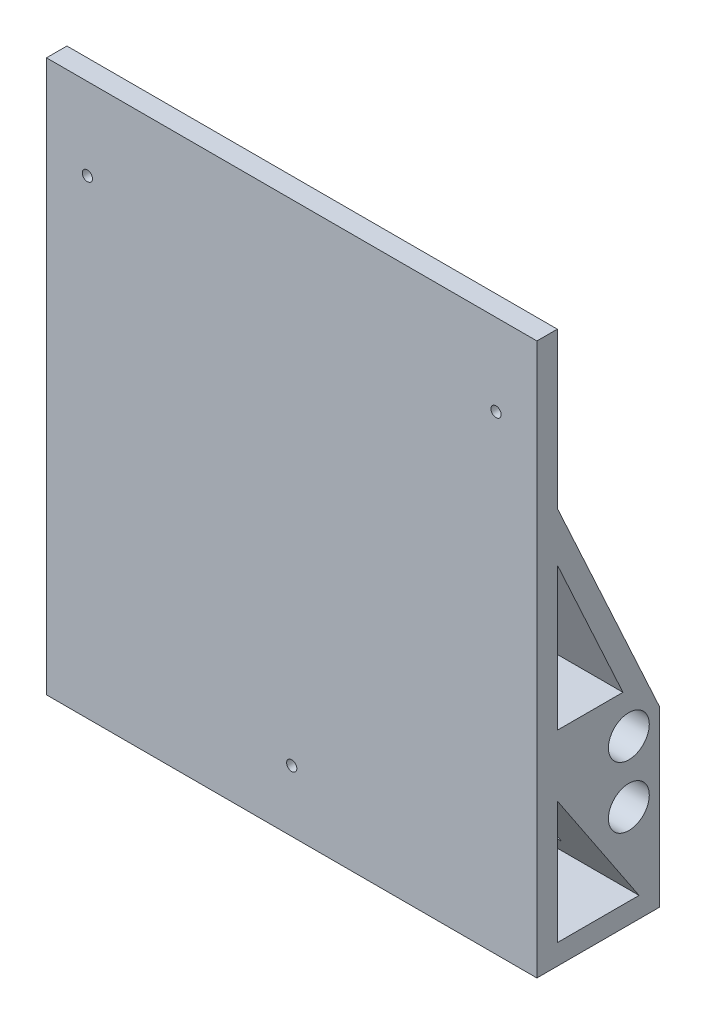
ISO-10303-21;
HEADER;
FILE_DESCRIPTION(('STEP AP214'),'2;1');
FILE_NAME('part.step','',(''),(''),'','','');
FILE_SCHEMA(('AUTOMOTIVE_DESIGN { 1 0 10303 214 1 1 1 1 }'));
ENDSEC;
DATA;
#1=APPLICATION_CONTEXT('core data for automotive mechanical design processes');
#2=APPLICATION_PROTOCOL_DEFINITION('international standard','automotive_design',2000,#1);
#3=PRODUCT_CONTEXT('',#1,'mechanical');
#4=PRODUCT('Part','Part','',(#3));
#5=PRODUCT_RELATED_PRODUCT_CATEGORY('part','',(#4));
#6=PRODUCT_DEFINITION_FORMATION('','',#4);
#7=PRODUCT_DEFINITION_CONTEXT('part definition',#1,'design');
#8=PRODUCT_DEFINITION('design','',#6,#7);
#9=PRODUCT_DEFINITION_SHAPE('','',#8);
#10=(LENGTH_UNIT() NAMED_UNIT(*) SI_UNIT(.MILLI.,.METRE.));
#11=(NAMED_UNIT(*) PLANE_ANGLE_UNIT() SI_UNIT($,.RADIAN.));
#12=(NAMED_UNIT(*) SI_UNIT($,.STERADIAN.) SOLID_ANGLE_UNIT());
#13=UNCERTAINTY_MEASURE_WITH_UNIT(LENGTH_MEASURE(1.E-05),#10,'distance_accuracy_value','');
#14=(GEOMETRIC_REPRESENTATION_CONTEXT(3) GLOBAL_UNCERTAINTY_ASSIGNED_CONTEXT((#13)) GLOBAL_UNIT_ASSIGNED_CONTEXT((#10,
#11,#12)) REPRESENTATION_CONTEXT('',''));
#15=CARTESIAN_POINT('',(0.,0.,0.));
#16=DIRECTION('',(0.,0.,1.));
#17=DIRECTION('',(1.,0.,0.));
#18=AXIS2_PLACEMENT_3D('',#15,#16,#17);
#19=CARTESIAN_POINT('',(-120.,5.,-5.));
#20=DIRECTION('',(0.,0.,1.));
#21=DIRECTION('',(0.,-1.,0.));
#22=AXIS2_PLACEMENT_3D('',#19,#20,#21);
#23=PLANE('',#22);
#24=CARTESIAN_POINT('',(-60.,15.,-5.));
#25=DIRECTION('',(0.,0.,1.));
#26=DIRECTION('',(0.,-1.,0.));
#27=AXIS2_PLACEMENT_3D('',#24,#25,#26);
#28=CIRCLE('',#27,1.25000000000001);
#29=CARTESIAN_POINT('',(-60.,13.75,-5.));
#30=VERTEX_POINT('',#29);
#31=EDGE_CURVE('E275',#30,#30,#28,.T.);
#32=ORIENTED_EDGE('',*,*,#31,.T.);
#33=EDGE_LOOP('',(#32));
#34=FACE_BOUND('',#33,.T.);
#35=DIRECTION('',(0.,1.,0.));
#36=VECTOR('',#35,1.);
#37=CARTESIAN_POINT('',(-105.,33.5,-5.));
#38=LINE('',#37,#36);
#39=CARTESIAN_POINT('',(-105.,33.5,-5.));
#40=VERTEX_POINT('',#39);
#41=CARTESIAN_POINT('',(-105.,35.,-5.));
#42=VERTEX_POINT('',#41);
#43=EDGE_CURVE('E230',#40,#42,#38,.T.);
#44=ORIENTED_EDGE('',*,*,#43,.F.);
#45=DIRECTION('',(-1.,0.,0.));
#46=VECTOR('',#45,1.);
#47=CARTESIAN_POINT('',(-105.,33.5,-5.));
#48=LINE('',#47,#46);
#49=CARTESIAN_POINT('',(-15.,33.5,-5.));
#50=VERTEX_POINT('',#49);
#51=EDGE_CURVE('E227',#50,#40,#48,.T.);
#52=ORIENTED_EDGE('',*,*,#51,.F.);
#53=DIRECTION('',(0.,1.,0.));
#54=VECTOR('',#53,1.);
#55=CARTESIAN_POINT('',(-15.,33.5,-5.));
#56=LINE('',#55,#54);
#57=CARTESIAN_POINT('',(-15.,35.,-5.));
#58=VERTEX_POINT('',#57);
#59=EDGE_CURVE('E233',#50,#58,#56,.T.);
#60=ORIENTED_EDGE('',*,*,#59,.T.);
#61=DIRECTION('',(1.,0.,0.));
#62=VECTOR('',#61,1.);
#63=CARTESIAN_POINT('',(-120.,35.,-5.));
#64=LINE('',#63,#62);
#65=CARTESIAN_POINT('',(0.,35.,-5.));
#66=VERTEX_POINT('',#65);
#67=EDGE_CURVE('E336',#58,#66,#64,.T.);
#68=ORIENTED_EDGE('',*,*,#67,.T.);
#69=DIRECTION('',(0.,-1.,0.));
#70=VECTOR('',#69,1.);
#71=CARTESIAN_POINT('',(0.,5.,-5.));
#72=LINE('',#71,#70);
#73=CARTESIAN_POINT('',(0.,5.,-5.));
#74=VERTEX_POINT('',#73);
#75=EDGE_CURVE('E304',#66,#74,#72,.T.);
#76=ORIENTED_EDGE('',*,*,#75,.T.);
#77=DIRECTION('',(1.,0.,0.));
#78=VECTOR('',#77,1.);
#79=CARTESIAN_POINT('',(-120.,5.,-5.));
#80=LINE('',#79,#78);
#81=CARTESIAN_POINT('',(-120.,5.,-5.));
#82=VERTEX_POINT('',#81);
#83=EDGE_CURVE('E321',#82,#74,#80,.T.);
#84=ORIENTED_EDGE('',*,*,#83,.F.);
#85=DIRECTION('',(0.,-1.,0.));
#86=VECTOR('',#85,1.);
#87=CARTESIAN_POINT('',(-120.,5.,-5.));
#88=LINE('',#87,#86);
#89=CARTESIAN_POINT('',(-120.,35.,-5.));
#90=VERTEX_POINT('',#89);
#91=EDGE_CURVE('E308',#90,#82,#88,.T.);
#92=ORIENTED_EDGE('',*,*,#91,.F.);
#93=EDGE_CURVE('E331',#90,#42,#64,.T.);
#94=ORIENTED_EDGE('',*,*,#93,.T.);
#95=EDGE_LOOP('',(#44,#52,#60,#68,#76,#84,#92,#94));
#96=FACE_BOUND('',#95,.T.);
#97=ADVANCED_FACE('F38',(#34,#96),#23,.F.);
#98=CARTESIAN_POINT('',(-120.,40.,-22.5));
#99=DIRECTION('',(1.,0.,0.));
#100=DIRECTION('',(0.,0.,-1.));
#101=AXIS2_PLACEMENT_3D('',#98,#99,#100);
#102=CYLINDRICAL_SURFACE('',#101,5.);
#103=CARTESIAN_POINT('',(0.,40.,-22.5));
#104=DIRECTION('',(1.,0.,0.));
#105=DIRECTION('',(0.,0.,-1.));
#106=AXIS2_PLACEMENT_3D('',#103,#104,#105);
#107=CIRCLE('',#106,5.);
#108=CARTESIAN_POINT('',(0.,40.,-27.5));
#109=VERTEX_POINT('',#108);
#110=EDGE_CURVE('E288',#109,#109,#107,.T.);
#111=ORIENTED_EDGE('',*,*,#110,.T.);
#112=EDGE_LOOP('',(#111));
#113=FACE_BOUND('',#112,.T.);
#114=CARTESIAN_POINT('',(-9.99999999999999,40.,-22.5));
#115=DIRECTION('',(-1.,0.,0.));
#116=DIRECTION('',(0.,-1.,0.));
#117=AXIS2_PLACEMENT_3D('',#114,#115,#116);
#118=CIRCLE('',#117,5.);
#119=CARTESIAN_POINT('',(-9.99999999999999,35.,-22.5));
#120=VERTEX_POINT('',#119);
#121=EDGE_CURVE('E11',#120,#120,#118,.F.);
#122=ORIENTED_EDGE('',*,*,#121,.F.);
#123=EDGE_LOOP('',(#122));
#124=FACE_BOUND('',#123,.T.);
#125=ADVANCED_FACE('F507',(#113,#124),#102,.F.);
#126=CARTESIAN_POINT('',(-120.,25.,-22.5));
#127=DIRECTION('',(1.,0.,0.));
#128=DIRECTION('',(0.,0.,-1.));
#129=AXIS2_PLACEMENT_3D('',#126,#127,#128);
#130=CYLINDRICAL_SURFACE('',#129,5.);
#131=CARTESIAN_POINT('',(-120.,25.,-22.5));
#132=DIRECTION('',(1.,0.,0.));
#133=DIRECTION('',(0.,0.,-1.));
#134=AXIS2_PLACEMENT_3D('',#131,#132,#133);
#135=CIRCLE('',#134,5.);
#136=CARTESIAN_POINT('',(-120.,25.,-27.5));
#137=VERTEX_POINT('',#136);
#138=EDGE_CURVE('E300',#137,#137,#135,.T.);
#139=ORIENTED_EDGE('',*,*,#138,.F.);
#140=EDGE_LOOP('',(#139));
#141=FACE_BOUND('',#140,.T.);
#142=CARTESIAN_POINT('',(-110.,25.,-22.5));
#143=DIRECTION('',(1.,0.,0.));
#144=DIRECTION('',(0.,0.,-1.));
#145=AXIS2_PLACEMENT_3D('',#142,#143,#144);
#146=CIRCLE('',#145,5.);
#147=CARTESIAN_POINT('',(-110.,25.,-27.5));
#148=VERTEX_POINT('',#147);
#149=EDGE_CURVE('E48',#148,#148,#146,.F.);
#150=ORIENTED_EDGE('',*,*,#149,.F.);
#151=EDGE_LOOP('',(#150));
#152=FACE_BOUND('',#151,.T.);
#153=ADVANCED_FACE('F515',(#141,#152),#130,.F.);
#154=CARTESIAN_POINT('',(0.,25.,-22.5));
#155=DIRECTION('',(1.,0.,0.));
#156=DIRECTION('',(0.,0.,-1.));
#157=AXIS2_PLACEMENT_3D('',#154,#155,#156);
#158=CIRCLE('',#157,5.);
#159=CARTESIAN_POINT('',(0.,25.,-27.5));
#160=VERTEX_POINT('',#159);
#161=EDGE_CURVE('E296',#160,#160,#158,.T.);
#162=ORIENTED_EDGE('',*,*,#161,.T.);
#163=EDGE_LOOP('',(#162));
#164=FACE_BOUND('',#163,.T.);
#165=CARTESIAN_POINT('',(-9.99999999999999,25.,-22.5));
#166=DIRECTION('',(-1.,0.,0.));
#167=DIRECTION('',(0.,-1.,0.));
#168=AXIS2_PLACEMENT_3D('',#165,#166,#167);
#169=CIRCLE('',#168,5.);
#170=CARTESIAN_POINT('',(-9.99999999999999,20.,-22.5));
#171=VERTEX_POINT('',#170);
#172=EDGE_CURVE('E417',#171,#171,#169,.F.);
#173=ORIENTED_EDGE('',*,*,#172,.F.);
#174=EDGE_LOOP('',(#173));
#175=FACE_BOUND('',#174,.T.);
#176=ADVANCED_FACE('F751',(#164,#175),#130,.F.);
#177=CARTESIAN_POINT('',(-120.,0.,0.));
#178=DIRECTION('',(0.,-1.,0.));
#179=DIRECTION('',(0.,0.,-1.));
#180=AXIS2_PLACEMENT_3D('',#177,#178,#179);
#181=PLANE('',#180);
#182=DIRECTION('',(0.,0.,-1.));
#183=VECTOR('',#182,1.);
#184=CARTESIAN_POINT('',(0.,0.,0.));
#185=LINE('',#184,#183);
#186=CARTESIAN_POINT('',(0.,0.,0.));
#187=VERTEX_POINT('',#186);
#188=CARTESIAN_POINT('',(0.,0.,-30.));
#189=VERTEX_POINT('',#188);
#190=EDGE_CURVE('E335',#187,#189,#185,.T.);
#191=ORIENTED_EDGE('',*,*,#190,.F.);
#192=DIRECTION('',(1.,0.,0.));
#193=VECTOR('',#192,1.);
#194=CARTESIAN_POINT('',(-120.,0.,0.));
#195=LINE('',#194,#193);
#196=CARTESIAN_POINT('',(-120.,0.,0.));
#197=VERTEX_POINT('',#196);
#198=EDGE_CURVE('E391',#197,#187,#195,.T.);
#199=ORIENTED_EDGE('',*,*,#198,.F.);
#200=DIRECTION('',(0.,0.,-1.));
#201=VECTOR('',#200,1.);
#202=CARTESIAN_POINT('',(-120.,0.,0.));
#203=LINE('',#202,#201);
#204=CARTESIAN_POINT('',(-120.,0.,-30.));
#205=VERTEX_POINT('',#204);
#206=EDGE_CURVE('E343',#197,#205,#203,.T.);
#207=ORIENTED_EDGE('',*,*,#206,.T.);
#208=DIRECTION('',(1.,0.,0.));
#209=VECTOR('',#208,1.);
#210=CARTESIAN_POINT('',(-120.,0.,-30.));
#211=LINE('',#210,#209);
#212=CARTESIAN_POINT('',(-60.,0.,-30.));
#213=VERTEX_POINT('',#212);
#214=EDGE_CURVE('E407',#205,#213,#211,.T.);
#215=ORIENTED_EDGE('',*,*,#214,.T.);
#216=EDGE_CURVE('E368',#213,#189,#211,.T.);
#217=ORIENTED_EDGE('',*,*,#216,.T.);
#218=EDGE_LOOP('',(#191,#199,#207,#215,#217));
#219=FACE_BOUND('',#218,.T.);
#220=ADVANCED_FACE('F40',(#219),#181,.T.);
#221=CARTESIAN_POINT('',(-120.,0.,0.));
#222=DIRECTION('',(0.,0.,1.));
#223=DIRECTION('',(1.,0.,0.));
#224=AXIS2_PLACEMENT_3D('',#221,#222,#223);
#225=PLANE('',#224);
#226=CARTESIAN_POINT('',(-110.,115.,0.));
#227=DIRECTION('',(0.,0.,1.));
#228=DIRECTION('',(1.,0.,0.));
#229=AXIS2_PLACEMENT_3D('',#226,#227,#228);
#230=CIRCLE('',#229,1.25);
#231=CARTESIAN_POINT('',(-108.75,115.,0.));
#232=VERTEX_POINT('',#231);
#233=EDGE_CURVE('E206',#232,#232,#230,.T.);
#234=ORIENTED_EDGE('',*,*,#233,.F.);
#235=EDGE_LOOP('',(#234));
#236=FACE_BOUND('',#235,.T.);
#237=CARTESIAN_POINT('',(-9.99999999999999,115.,0.));
#238=DIRECTION('',(0.,0.,1.));
#239=DIRECTION('',(-1.,0.,0.));
#240=AXIS2_PLACEMENT_3D('',#237,#238,#239);
#241=CIRCLE('',#240,1.25);
#242=CARTESIAN_POINT('',(-11.25,115.,0.));
#243=VERTEX_POINT('',#242);
#244=EDGE_CURVE('E203',#243,#243,#241,.T.);
#245=ORIENTED_EDGE('',*,*,#244,.F.);
#246=EDGE_LOOP('',(#245));
#247=FACE_BOUND('',#246,.T.);
#248=CARTESIAN_POINT('',(-60.,15.,0.));
#249=DIRECTION('',(0.,0.,1.));
#250=DIRECTION('',(1.,0.,0.));
#251=AXIS2_PLACEMENT_3D('',#248,#249,#250);
#252=CIRCLE('',#251,1.25000000000001);
#253=CARTESIAN_POINT('',(-58.75,15.,0.));
#254=VERTEX_POINT('',#253);
#255=EDGE_CURVE('E271',#254,#254,#252,.T.);
#256=ORIENTED_EDGE('',*,*,#255,.F.);
#257=EDGE_LOOP('',(#256));
#258=FACE_BOUND('',#257,.T.);
#259=DIRECTION('',(0.,-1.,0.));
#260=VECTOR('',#259,1.);
#261=CARTESIAN_POINT('',(0.,0.,0.));
#262=LINE('',#261,#260);
#263=CARTESIAN_POINT('',(0.,135.,0.));
#264=VERTEX_POINT('',#263);
#265=EDGE_CURVE('E348',#264,#187,#262,.T.);
#266=ORIENTED_EDGE('',*,*,#265,.F.);
#267=DIRECTION('',(1.,0.,0.));
#268=VECTOR('',#267,1.);
#269=CARTESIAN_POINT('',(-120.,135.,0.));
#270=LINE('',#269,#268);
#271=CARTESIAN_POINT('',(-120.,135.,0.));
#272=VERTEX_POINT('',#271);
#273=EDGE_CURVE('E395',#272,#264,#270,.T.);
#274=ORIENTED_EDGE('',*,*,#273,.F.);
#275=DIRECTION('',(0.,-1.,0.));
#276=VECTOR('',#275,1.);
#277=CARTESIAN_POINT('',(-120.,0.,0.));
#278=LINE('',#277,#276);
#279=EDGE_CURVE('E364',#272,#197,#278,.T.);
#280=ORIENTED_EDGE('',*,*,#279,.T.);
#281=ORIENTED_EDGE('',*,*,#198,.T.);
#282=EDGE_LOOP('',(#266,#274,#280,#281));
#283=FACE_BOUND('',#282,.T.);
#284=ADVANCED_FACE('F482',(#236,#247,#258,#283),#225,.T.);
#285=CARTESIAN_POINT('',(-120.,135.,0.));
#286=DIRECTION('',(0.,1.,0.));
#287=DIRECTION('',(0.,0.,1.));
#288=AXIS2_PLACEMENT_3D('',#285,#286,#287);
#289=PLANE('',#288);
#290=DIRECTION('',(0.,0.,1.));
#291=VECTOR('',#290,1.);
#292=CARTESIAN_POINT('',(0.,135.,0.));
#293=LINE('',#292,#291);
#294=CARTESIAN_POINT('',(0.,135.,-5.));
#295=VERTEX_POINT('',#294);
#296=EDGE_CURVE('E384',#295,#264,#293,.T.);
#297=ORIENTED_EDGE('',*,*,#296,.F.);
#298=DIRECTION('',(1.,0.,0.));
#299=VECTOR('',#298,1.);
#300=CARTESIAN_POINT('',(-120.,135.,-5.));
#301=LINE('',#300,#299);
#302=CARTESIAN_POINT('',(-120.,135.,-5.));
#303=VERTEX_POINT('',#302);
#304=EDGE_CURVE('E398',#303,#295,#301,.T.);
#305=ORIENTED_EDGE('',*,*,#304,.F.);
#306=DIRECTION('',(0.,0.,1.));
#307=VECTOR('',#306,1.);
#308=CARTESIAN_POINT('',(-120.,135.,0.));
#309=LINE('',#308,#307);
#310=EDGE_CURVE('E360',#303,#272,#309,.T.);
#311=ORIENTED_EDGE('',*,*,#310,.T.);
#312=ORIENTED_EDGE('',*,*,#273,.T.);
#313=EDGE_LOOP('',(#297,#305,#311,#312));
#314=FACE_BOUND('',#313,.T.);
#315=ADVANCED_FACE('F527',(#314),#289,.T.);
#316=CARTESIAN_POINT('',(-120.,97.,-5.));
#317=DIRECTION('',(0.,0.,-1.));
#318=DIRECTION('',(0.,1.,0.));
#319=AXIS2_PLACEMENT_3D('',#316,#317,#318);
#320=PLANE('',#319);
#321=CARTESIAN_POINT('',(-110.,115.,-5.));
#322=DIRECTION('',(0.,0.,-1.));
#323=DIRECTION('',(0.,1.,0.));
#324=AXIS2_PLACEMENT_3D('',#321,#322,#323);
#325=CIRCLE('',#324,1.25);
#326=CARTESIAN_POINT('',(-110.,116.25,-5.));
#327=VERTEX_POINT('',#326);
#328=EDGE_CURVE('E42',#327,#327,#325,.T.);
#329=ORIENTED_EDGE('',*,*,#328,.F.);
#330=EDGE_LOOP('',(#329));
#331=FACE_BOUND('',#330,.T.);
#332=CARTESIAN_POINT('',(-9.99999999999999,115.,-5.));
#333=DIRECTION('',(0.,0.,-1.));
#334=DIRECTION('',(0.,1.,0.));
#335=AXIS2_PLACEMENT_3D('',#332,#333,#334);
#336=CIRCLE('',#335,1.25);
#337=CARTESIAN_POINT('',(-9.99999999999999,116.25,-5.));
#338=VERTEX_POINT('',#337);
#339=EDGE_CURVE('E210',#338,#338,#336,.T.);
#340=ORIENTED_EDGE('',*,*,#339,.F.);
#341=EDGE_LOOP('',(#340));
#342=FACE_BOUND('',#341,.T.);
#343=DIRECTION('',(0.,1.,0.));
#344=VECTOR('',#343,1.);
#345=CARTESIAN_POINT('',(0.,97.,-5.));
#346=LINE('',#345,#344);
#347=CARTESIAN_POINT('',(0.,97.,-5.));
#348=VERTEX_POINT('',#347);
#349=EDGE_CURVE('E380',#348,#295,#346,.T.);
#350=ORIENTED_EDGE('',*,*,#349,.F.);
#351=DIRECTION('',(1.,0.,0.));
#352=VECTOR('',#351,1.);
#353=CARTESIAN_POINT('',(-120.,97.,-5.));
#354=LINE('',#353,#352);
#355=CARTESIAN_POINT('',(-120.,97.,-5.));
#356=VERTEX_POINT('',#355);
#357=EDGE_CURVE('E401',#356,#348,#354,.T.);
#358=ORIENTED_EDGE('',*,*,#357,.F.);
#359=DIRECTION('',(0.,1.,0.));
#360=VECTOR('',#359,1.);
#361=CARTESIAN_POINT('',(-120.,97.,-5.));
#362=LINE('',#361,#360);
#363=EDGE_CURVE('E356',#356,#303,#362,.T.);
#364=ORIENTED_EDGE('',*,*,#363,.T.);
#365=ORIENTED_EDGE('',*,*,#304,.T.);
#366=EDGE_LOOP('',(#350,#358,#364,#365));
#367=FACE_BOUND('',#366,.T.);
#368=ADVANCED_FACE('F531',(#331,#342,#367),#320,.T.);
#369=CARTESIAN_POINT('',(-120.,42.5,-30.));
#370=DIRECTION('',(0.,0.41694182324625,-0.908933174676826));
#371=DIRECTION('',(0.,0.908933174676826,0.41694182324625));
#372=AXIS2_PLACEMENT_3D('',#369,#370,#371);
#373=PLANE('',#372);
#374=CARTESIAN_POINT('',(-60.,52.25,-25.5275229357798));
#375=DIRECTION('',(0.,0.41694182324625,-0.908933174676826));
#376=DIRECTION('',(0.,-0.908933174676826,-0.41694182324625));
#377=AXIS2_PLACEMENT_3D('',#374,#375,#376);
#378=ELLIPSE('',#377,4.12571584410848,3.75);
#379=CARTESIAN_POINT('',(-60.,48.5,-27.2477064220184));
#380=VERTEX_POINT('',#379);
#381=EDGE_CURVE('E394',#380,#380,#378,.T.);
#382=ORIENTED_EDGE('',*,*,#381,.F.);
#383=EDGE_LOOP('',(#382));
#384=FACE_BOUND('',#383,.T.);
#385=DIRECTION('',(0.,0.908933174676826,0.41694182324625));
#386=VECTOR('',#385,1.);
#387=CARTESIAN_POINT('',(0.,42.5,-30.));
#388=LINE('',#387,#386);
#389=CARTESIAN_POINT('',(0.,42.5,-30.));
#390=VERTEX_POINT('',#389);
#391=EDGE_CURVE('E376',#390,#348,#388,.T.);
#392=ORIENTED_EDGE('',*,*,#391,.F.);
#393=DIRECTION('',(1.,0.,0.));
#394=VECTOR('',#393,1.);
#395=CARTESIAN_POINT('',(-120.,42.5,-30.));
#396=LINE('',#395,#394);
#397=CARTESIAN_POINT('',(-120.,42.5,-30.));
#398=VERTEX_POINT('',#397);
#399=EDGE_CURVE('E404',#398,#390,#396,.T.);
#400=ORIENTED_EDGE('',*,*,#399,.F.);
#401=DIRECTION('',(0.,0.908933174676826,0.41694182324625));
#402=VECTOR('',#401,1.);
#403=CARTESIAN_POINT('',(-120.,42.5,-30.));
#404=LINE('',#403,#402);
#405=EDGE_CURVE('E352',#398,#356,#404,.T.);
#406=ORIENTED_EDGE('',*,*,#405,.T.);
#407=ORIENTED_EDGE('',*,*,#357,.T.);
#408=EDGE_LOOP('',(#392,#400,#406,#407));
#409=FACE_BOUND('',#408,.T.);
#410=ADVANCED_FACE('F535',(#384,#409),#373,.T.);
#411=CARTESIAN_POINT('',(-120.,0.,-30.));
#412=DIRECTION('',(0.,0.,-1.));
#413=DIRECTION('',(-1.,0.,0.));
#414=AXIS2_PLACEMENT_3D('',#411,#412,#413);
#415=PLANE('',#414);
#416=DIRECTION('',(1.,0.,0.));
#417=VECTOR('',#416,1.);
#418=CARTESIAN_POINT('',(-105.,33.5,-30.));
#419=LINE('',#418,#417);
#420=CARTESIAN_POINT('',(-105.,33.5,-30.));
#421=VERTEX_POINT('',#420);
#422=CARTESIAN_POINT('',(-15.,33.5,-30.));
#423=VERTEX_POINT('',#422);
#424=EDGE_CURVE('E218',#421,#423,#419,.T.);
#425=ORIENTED_EDGE('',*,*,#424,.F.);
#426=DIRECTION('',(0.,1.,0.));
#427=VECTOR('',#426,1.);
#428=CARTESIAN_POINT('',(-105.,11.,-30.));
#429=LINE('',#428,#427);
#430=CARTESIAN_POINT('',(-105.,11.,-30.));
#431=VERTEX_POINT('',#430);
#432=EDGE_CURVE('E251',#431,#421,#429,.T.);
#433=ORIENTED_EDGE('',*,*,#432,.F.);
#434=DIRECTION('',(-1.,0.,0.));
#435=VECTOR('',#434,1.);
#436=CARTESIAN_POINT('',(-15.,11.,-30.));
#437=LINE('',#436,#435);
#438=CARTESIAN_POINT('',(-15.,11.,-30.));
#439=VERTEX_POINT('',#438);
#440=EDGE_CURVE('E247',#439,#431,#437,.T.);
#441=ORIENTED_EDGE('',*,*,#440,.F.);
#442=DIRECTION('',(0.,-1.,0.));
#443=VECTOR('',#442,1.);
#444=CARTESIAN_POINT('',(-15.,36.,-30.));
#445=LINE('',#444,#443);
#446=EDGE_CURVE('E244',#423,#439,#445,.T.);
#447=ORIENTED_EDGE('',*,*,#446,.F.);
#448=EDGE_LOOP('',(#425,#433,#441,#447));
#449=FACE_BOUND('',#448,.T.);
#450=ORIENTED_EDGE('',*,*,#216,.F.);
#451=CARTESIAN_POINT('',(-60.,3.75,-30.));
#452=DIRECTION('',(0.,0.,-1.));
#453=DIRECTION('',(-1.,0.,0.));
#454=AXIS2_PLACEMENT_3D('',#451,#452,#453);
#455=CIRCLE('',#454,3.75000000000001);
#456=EDGE_CURVE('E283',#213,#213,#455,.T.);
#457=ORIENTED_EDGE('',*,*,#456,.F.);
#458=ORIENTED_EDGE('',*,*,#214,.F.);
#459=DIRECTION('',(0.,1.,0.));
#460=VECTOR('',#459,1.);
#461=CARTESIAN_POINT('',(-120.,0.,-30.));
#462=LINE('',#461,#460);
#463=EDGE_CURVE('E347',#205,#398,#462,.T.);
#464=ORIENTED_EDGE('',*,*,#463,.T.);
#465=ORIENTED_EDGE('',*,*,#399,.T.);
#466=DIRECTION('',(0.,1.,0.));
#467=VECTOR('',#466,1.);
#468=CARTESIAN_POINT('',(0.,0.,-30.));
#469=LINE('',#468,#467);
#470=EDGE_CURVE('E372',#189,#390,#469,.T.);
#471=ORIENTED_EDGE('',*,*,#470,.F.);
#472=EDGE_LOOP('',(#450,#457,#458,#464,#465,#471));
#473=FACE_BOUND('',#472,.T.);
#474=ADVANCED_FACE('F442',(#449,#473),#415,.T.);
#475=CARTESIAN_POINT('',(-120.,0.,0.));
#476=DIRECTION('',(1.,0.,0.));
#477=DIRECTION('',(0.,0.,-1.));
#478=AXIS2_PLACEMENT_3D('',#475,#476,#477);
#479=PLANE('',#478);
#480=DIRECTION('',(0.,0.,-1.));
#481=VECTOR('',#480,1.);
#482=CARTESIAN_POINT('',(-120.,50.0079192797913,-5.00000000000001));
#483=LINE('',#482,#481);
#484=CARTESIAN_POINT('',(-120.,50.0079192797913,-5.00000000000001));
#485=VERTEX_POINT('',#484);
#486=CARTESIAN_POINT('',(-120.,50.0079192797913,-21.0550458715596));
#487=VERTEX_POINT('',#486);
#488=EDGE_CURVE('E56',#485,#487,#483,.T.);
#489=ORIENTED_EDGE('',*,*,#488,.T.);
#490=DIRECTION('',(0.,0.908933174676826,0.41694182324625));
#491=VECTOR('',#490,1.);
#492=CARTESIAN_POINT('',(-120.,50.0079192797913,-21.0550458715596));
#493=LINE('',#492,#491);
#494=CARTESIAN_POINT('',(-120.,85.0079192797914,-5.));
#495=VERTEX_POINT('',#494);
#496=EDGE_CURVE('E171',#487,#495,#493,.T.);
#497=ORIENTED_EDGE('',*,*,#496,.T.);
#498=DIRECTION('',(0.,-1.,0.));
#499=VECTOR('',#498,1.);
#500=CARTESIAN_POINT('',(-120.,85.0079192797914,-5.));
#501=LINE('',#500,#499);
#502=EDGE_CURVE('E179',#495,#485,#501,.T.);
#503=ORIENTED_EDGE('',*,*,#502,.T.);
#504=EDGE_LOOP('',(#489,#497,#503));
#505=FACE_BOUND('',#504,.T.);
#506=CARTESIAN_POINT('',(-120.,40.,-22.5));
#507=DIRECTION('',(1.,0.,0.));
#508=DIRECTION('',(0.,0.,-1.));
#509=AXIS2_PLACEMENT_3D('',#506,#507,#508);
#510=CIRCLE('',#509,5.);
#511=CARTESIAN_POINT('',(-120.,40.,-27.5));
#512=VERTEX_POINT('',#511);
#513=EDGE_CURVE('E292',#512,#512,#510,.T.);
#514=ORIENTED_EDGE('',*,*,#513,.T.);
#515=EDGE_LOOP('',(#514));
#516=FACE_BOUND('',#515,.T.);
#517=ORIENTED_EDGE('',*,*,#138,.T.);
#518=EDGE_LOOP('',(#517));
#519=FACE_BOUND('',#518,.T.);
#520=DIRECTION('',(0.,0.832050294337844,0.554700196225229));
#521=VECTOR('',#520,1.);
#522=CARTESIAN_POINT('',(-120.,5.,-25.));
#523=LINE('',#522,#521);
#524=CARTESIAN_POINT('',(-120.,5.,-25.));
#525=VERTEX_POINT('',#524);
#526=EDGE_CURVE('E317',#525,#90,#523,.T.);
#527=ORIENTED_EDGE('',*,*,#526,.T.);
#528=ORIENTED_EDGE('',*,*,#91,.T.);
#529=DIRECTION('',(0.,0.,-1.));
#530=VECTOR('',#529,1.);
#531=CARTESIAN_POINT('',(-120.,5.,-5.));
#532=LINE('',#531,#530);
#533=EDGE_CURVE('E312',#82,#525,#532,.T.);
#534=ORIENTED_EDGE('',*,*,#533,.T.);
#535=EDGE_LOOP('',(#527,#528,#534));
#536=FACE_BOUND('',#535,.T.);
#537=ORIENTED_EDGE('',*,*,#206,.F.);
#538=ORIENTED_EDGE('',*,*,#279,.F.);
#539=ORIENTED_EDGE('',*,*,#310,.F.);
#540=ORIENTED_EDGE('',*,*,#363,.F.);
#541=ORIENTED_EDGE('',*,*,#405,.F.);
#542=ORIENTED_EDGE('',*,*,#463,.F.);
#543=EDGE_LOOP('',(#537,#538,#539,#540,#541,#542));
#544=FACE_BOUND('',#543,.T.);
#545=ADVANCED_FACE('F184',(#505,#516,#519,#536,#544),#479,.F.);
#546=CARTESIAN_POINT('',(0.,0.,0.));
#547=DIRECTION('',(1.,0.,0.));
#548=DIRECTION('',(0.,0.,-1.));
#549=AXIS2_PLACEMENT_3D('',#546,#547,#548);
#550=PLANE('',#549);
#551=DIRECTION('',(0.,0.908933174676826,0.41694182324625));
#552=VECTOR('',#551,1.);
#553=CARTESIAN_POINT('',(0.,50.0079192797913,-21.0550458715596));
#554=LINE('',#553,#552);
#555=CARTESIAN_POINT('',(0.,50.0079192797913,-21.0550458715596));
#556=VERTEX_POINT('',#555);
#557=CARTESIAN_POINT('',(0.,85.0079192797914,-5.));
#558=VERTEX_POINT('',#557);
#559=EDGE_CURVE('E64',#556,#558,#554,.T.);
#560=ORIENTED_EDGE('',*,*,#559,.F.);
#561=DIRECTION('',(0.,0.,-1.));
#562=VECTOR('',#561,1.);
#563=CARTESIAN_POINT('',(0.,50.0079192797913,-5.00000000000001));
#564=LINE('',#563,#562);
#565=CARTESIAN_POINT('',(0.,50.0079192797913,-5.00000000000001));
#566=VERTEX_POINT('',#565);
#567=EDGE_CURVE('E187',#566,#556,#564,.T.);
#568=ORIENTED_EDGE('',*,*,#567,.F.);
#569=DIRECTION('',(0.,-1.,0.));
#570=VECTOR('',#569,1.);
#571=CARTESIAN_POINT('',(0.,85.0079192797914,-5.));
#572=LINE('',#571,#570);
#573=EDGE_CURVE('E191',#558,#566,#572,.T.);
#574=ORIENTED_EDGE('',*,*,#573,.F.);
#575=EDGE_LOOP('',(#560,#568,#574));
#576=FACE_BOUND('',#575,.T.);
#577=ORIENTED_EDGE('',*,*,#110,.F.);
#578=EDGE_LOOP('',(#577));
#579=FACE_BOUND('',#578,.T.);
#580=ORIENTED_EDGE('',*,*,#161,.F.);
#581=EDGE_LOOP('',(#580));
#582=FACE_BOUND('',#581,.T.);
#583=ORIENTED_EDGE('',*,*,#75,.F.);
#584=DIRECTION('',(0.,0.832050294337844,0.554700196225229));
#585=VECTOR('',#584,1.);
#586=CARTESIAN_POINT('',(0.,5.,-25.));
#587=LINE('',#586,#585);
#588=CARTESIAN_POINT('',(0.,5.,-25.));
#589=VERTEX_POINT('',#588);
#590=EDGE_CURVE('E313',#589,#66,#587,.T.);
#591=ORIENTED_EDGE('',*,*,#590,.F.);
#592=DIRECTION('',(0.,0.,-1.));
#593=VECTOR('',#592,1.);
#594=CARTESIAN_POINT('',(0.,5.,-5.));
#595=LINE('',#594,#593);
#596=EDGE_CURVE('E324',#74,#589,#595,.T.);
#597=ORIENTED_EDGE('',*,*,#596,.F.);
#598=EDGE_LOOP('',(#583,#591,#597));
#599=FACE_BOUND('',#598,.T.);
#600=ORIENTED_EDGE('',*,*,#190,.T.);
#601=ORIENTED_EDGE('',*,*,#470,.T.);
#602=ORIENTED_EDGE('',*,*,#391,.T.);
#603=ORIENTED_EDGE('',*,*,#349,.T.);
#604=ORIENTED_EDGE('',*,*,#296,.T.);
#605=ORIENTED_EDGE('',*,*,#265,.T.);
#606=EDGE_LOOP('',(#600,#601,#602,#603,#604,#605));
#607=FACE_BOUND('',#606,.T.);
#608=ADVANCED_FACE('F478',(#576,#579,#582,#599,#607),#550,.T.);
#609=CARTESIAN_POINT('',(-120.,5.,-25.));
#610=DIRECTION('',(0.,0.554700196225229,-0.832050294337844));
#611=DIRECTION('',(0.,0.832050294337844,0.554700196225229));
#612=AXIS2_PLACEMENT_3D('',#609,#610,#611);
#613=PLANE('',#612);
#614=DIRECTION('',(-1.,0.,0.));
#615=VECTOR('',#614,1.);
#616=CARTESIAN_POINT('',(-120.,11.,-21.));
#617=LINE('',#616,#615);
#618=CARTESIAN_POINT('',(-15.,11.,-21.));
#619=VERTEX_POINT('',#618);
#620=CARTESIAN_POINT('',(-105.,11.,-21.));
#621=VERTEX_POINT('',#620);
#622=EDGE_CURVE('E413',#619,#621,#617,.T.);
#623=ORIENTED_EDGE('',*,*,#622,.T.);
#624=DIRECTION('',(0.,0.832050294337844,0.554700196225229));
#625=VECTOR('',#624,1.);
#626=CARTESIAN_POINT('',(-105.,5.,-25.));
#627=LINE('',#626,#625);
#628=CARTESIAN_POINT('',(-105.,33.5,-5.99999999999999));
#629=VERTEX_POINT('',#628);
#630=EDGE_CURVE('E267',#621,#629,#627,.T.);
#631=ORIENTED_EDGE('',*,*,#630,.T.);
#632=DIRECTION('',(0.,-0.832050294337844,-0.554700196225229));
#633=VECTOR('',#632,1.);
#634=CARTESIAN_POINT('',(-105.,5.,-25.));
#635=LINE('',#634,#633);
#636=EDGE_CURVE('E237',#42,#629,#635,.T.);
#637=ORIENTED_EDGE('',*,*,#636,.F.);
#638=ORIENTED_EDGE('',*,*,#93,.F.);
#639=ORIENTED_EDGE('',*,*,#526,.F.);
#640=DIRECTION('',(1.,0.,0.));
#641=VECTOR('',#640,1.);
#642=CARTESIAN_POINT('',(-120.,5.,-25.));
#643=LINE('',#642,#641);
#644=EDGE_CURVE('E337',#525,#589,#643,.T.);
#645=ORIENTED_EDGE('',*,*,#644,.T.);
#646=ORIENTED_EDGE('',*,*,#590,.T.);
#647=ORIENTED_EDGE('',*,*,#67,.F.);
#648=DIRECTION('',(0.,-0.832050294337844,-0.554700196225229));
#649=VECTOR('',#648,1.);
#650=CARTESIAN_POINT('',(-15.,4.99999999999999,-25.));
#651=LINE('',#650,#649);
#652=CARTESIAN_POINT('',(-15.,33.5,-6.));
#653=VERTEX_POINT('',#652);
#654=EDGE_CURVE('E263',#58,#653,#651,.T.);
#655=ORIENTED_EDGE('',*,*,#654,.T.);
#656=EDGE_CURVE('E259',#653,#619,#651,.T.);
#657=ORIENTED_EDGE('',*,*,#656,.T.);
#658=EDGE_LOOP('',(#623,#631,#637,#638,#639,#645,#646,#647,#655,#657));
#659=FACE_BOUND('',#658,.T.);
#660=ADVANCED_FACE('F467',(#659),#613,.F.);
#661=CARTESIAN_POINT('',(-120.,5.,-5.));
#662=DIRECTION('',(0.,-1.,0.));
#663=DIRECTION('',(0.,0.,-1.));
#664=AXIS2_PLACEMENT_3D('',#661,#662,#663);
#665=PLANE('',#664);
#666=ORIENTED_EDGE('',*,*,#596,.T.);
#667=ORIENTED_EDGE('',*,*,#644,.F.);
#668=ORIENTED_EDGE('',*,*,#533,.F.);
#669=ORIENTED_EDGE('',*,*,#83,.T.);
#670=EDGE_LOOP('',(#666,#667,#668,#669));
#671=FACE_BOUND('',#670,.T.);
#672=ADVANCED_FACE('F504',(#671),#665,.F.);
#673=CARTESIAN_POINT('',(-110.,40.,-22.5));
#674=DIRECTION('',(-1.,0.,0.));
#675=DIRECTION('',(0.,-1.,0.));
#676=AXIS2_PLACEMENT_3D('',#673,#674,#675);
#677=CIRCLE('',#676,5.);
#678=CARTESIAN_POINT('',(-110.,35.,-22.5));
#679=VERTEX_POINT('',#678);
#680=EDGE_CURVE('E240',#679,#679,#677,.T.);
#681=ORIENTED_EDGE('',*,*,#680,.F.);
#682=EDGE_LOOP('',(#681));
#683=FACE_BOUND('',#682,.T.);
#684=ORIENTED_EDGE('',*,*,#513,.F.);
#685=EDGE_LOOP('',(#684));
#686=FACE_BOUND('',#685,.T.);
#687=ADVANCED_FACE('F494',(#683,#686),#102,.F.);
#688=CARTESIAN_POINT('',(-60.,3.75,-50.));
#689=DIRECTION('',(0.,0.,1.));
#690=DIRECTION('',(1.,0.,0.));
#691=AXIS2_PLACEMENT_3D('',#688,#689,#690);
#692=CYLINDRICAL_SURFACE('',#691,3.75000000000001);
#693=CARTESIAN_POINT('',(-60.,3.75,-50.));
#694=DIRECTION('',(0.,0.,-1.));
#695=DIRECTION('',(-1.,0.,0.));
#696=AXIS2_PLACEMENT_3D('',#693,#694,#695);
#697=CIRCLE('',#696,3.75000000000001);
#698=CARTESIAN_POINT('',(-63.75,3.75,-50.));
#699=VERTEX_POINT('',#698);
#700=EDGE_CURVE('E284',#699,#699,#697,.T.);
#701=ORIENTED_EDGE('',*,*,#700,.F.);
#702=EDGE_LOOP('',(#701));
#703=FACE_BOUND('',#702,.T.);
#704=ORIENTED_EDGE('',*,*,#456,.T.);
#705=EDGE_LOOP('',(#704));
#706=FACE_BOUND('',#705,.T.);
#707=ADVANCED_FACE('F491',(#703,#706),#692,.T.);
#708=CARTESIAN_POINT('',(-60.,3.75,-50.));
#709=DIRECTION('',(0.,0.,-1.));
#710=DIRECTION('',(-1.,0.,0.));
#711=AXIS2_PLACEMENT_3D('',#708,#709,#710);
#712=PLANE('',#711);
#713=ORIENTED_EDGE('',*,*,#700,.T.);
#714=EDGE_LOOP('',(#713));
#715=FACE_BOUND('',#714,.T.);
#716=ADVANCED_FACE('F493',(#715),#712,.T.);
#717=CARTESIAN_POINT('',(-60.,52.25,-15.));
#718=DIRECTION('',(0.,0.,-1.));
#719=DIRECTION('',(-1.,0.,0.));
#720=AXIS2_PLACEMENT_3D('',#717,#718,#719);
#721=CYLINDRICAL_SURFACE('',#720,3.75);
#722=ORIENTED_EDGE('',*,*,#381,.T.);
#723=EDGE_LOOP('',(#722));
#724=FACE_BOUND('',#723,.T.);
#725=CARTESIAN_POINT('',(-60.,52.25,-50.));
#726=DIRECTION('',(0.,0.,-1.));
#727=DIRECTION('',(-1.,0.,0.));
#728=AXIS2_PLACEMENT_3D('',#725,#726,#727);
#729=CIRCLE('',#728,3.75);
#730=CARTESIAN_POINT('',(-63.75,52.25,-50.));
#731=VERTEX_POINT('',#730);
#732=EDGE_CURVE('E279',#731,#731,#729,.T.);
#733=ORIENTED_EDGE('',*,*,#732,.F.);
#734=EDGE_LOOP('',(#733));
#735=FACE_BOUND('',#734,.T.);
#736=ADVANCED_FACE('F501',(#724,#735),#721,.T.);
#737=CARTESIAN_POINT('',(-60.,52.25,-50.));
#738=DIRECTION('',(0.,0.,-1.));
#739=DIRECTION('',(-1.,0.,0.));
#740=AXIS2_PLACEMENT_3D('',#737,#738,#739);
#741=PLANE('',#740);
#742=ORIENTED_EDGE('',*,*,#732,.T.);
#743=EDGE_LOOP('',(#742));
#744=FACE_BOUND('',#743,.T.);
#745=ADVANCED_FACE('F700',(#744),#741,.T.);
#746=CARTESIAN_POINT('',(-60.,15.,-50.));
#747=DIRECTION('',(0.,0.,1.));
#748=DIRECTION('',(1.,0.,0.));
#749=AXIS2_PLACEMENT_3D('',#746,#747,#748);
#750=CYLINDRICAL_SURFACE('',#749,1.25000000000001);
#751=ORIENTED_EDGE('',*,*,#255,.T.);
#752=EDGE_LOOP('',(#751));
#753=FACE_BOUND('',#752,.T.);
#754=ORIENTED_EDGE('',*,*,#31,.F.);
#755=EDGE_LOOP('',(#754));
#756=FACE_BOUND('',#755,.T.);
#757=ADVANCED_FACE('F695',(#753,#756),#750,.F.);
#758=CARTESIAN_POINT('',(-15.,11.,-5.));
#759=DIRECTION('',(0.,-1.,0.));
#760=DIRECTION('',(0.,0.,-1.));
#761=AXIS2_PLACEMENT_3D('',#758,#759,#760);
#762=PLANE('',#761);
#763=DIRECTION('',(0.,0.,-1.));
#764=VECTOR('',#763,1.);
#765=CARTESIAN_POINT('',(-15.,11.,-5.));
#766=LINE('',#765,#764);
#767=EDGE_CURVE('E255',#619,#439,#766,.T.);
#768=ORIENTED_EDGE('',*,*,#767,.T.);
#769=ORIENTED_EDGE('',*,*,#440,.T.);
#770=DIRECTION('',(0.,0.,-1.));
#771=VECTOR('',#770,1.);
#772=CARTESIAN_POINT('',(-105.,11.,-5.));
#773=LINE('',#772,#771);
#774=EDGE_CURVE('E256',#621,#431,#773,.T.);
#775=ORIENTED_EDGE('',*,*,#774,.F.);
#776=ORIENTED_EDGE('',*,*,#622,.F.);
#777=EDGE_LOOP('',(#768,#769,#775,#776));
#778=FACE_BOUND('',#777,.T.);
#779=ADVANCED_FACE('F449',(#778),#762,.F.);
#780=CARTESIAN_POINT('',(-105.,11.,-5.));
#781=DIRECTION('',(-1.,0.,0.));
#782=DIRECTION('',(0.,0.,1.));
#783=AXIS2_PLACEMENT_3D('',#780,#781,#782);
#784=PLANE('',#783);
#785=ORIENTED_EDGE('',*,*,#432,.T.);
#786=DIRECTION('',(0.,0.,-1.));
#787=VECTOR('',#786,1.);
#788=CARTESIAN_POINT('',(-105.,33.5,-5.));
#789=LINE('',#788,#787);
#790=EDGE_CURVE('E219',#629,#421,#789,.T.);
#791=ORIENTED_EDGE('',*,*,#790,.F.);
#792=ORIENTED_EDGE('',*,*,#630,.F.);
#793=ORIENTED_EDGE('',*,*,#774,.T.);
#794=EDGE_LOOP('',(#785,#791,#792,#793));
#795=FACE_BOUND('',#794,.T.);
#796=ADVANCED_FACE('F445',(#795),#784,.F.);
#797=CARTESIAN_POINT('',(-15.,36.,-5.));
#798=DIRECTION('',(1.,0.,0.));
#799=DIRECTION('',(0.,1.,0.));
#800=AXIS2_PLACEMENT_3D('',#797,#798,#799);
#801=PLANE('',#800);
#802=ORIENTED_EDGE('',*,*,#656,.F.);
#803=DIRECTION('',(0.,0.,1.));
#804=VECTOR('',#803,1.);
#805=CARTESIAN_POINT('',(-15.,33.5,-5.));
#806=LINE('',#805,#804);
#807=EDGE_CURVE('E223',#423,#653,#806,.T.);
#808=ORIENTED_EDGE('',*,*,#807,.F.);
#809=ORIENTED_EDGE('',*,*,#446,.T.);
#810=ORIENTED_EDGE('',*,*,#767,.F.);
#811=EDGE_LOOP('',(#802,#808,#809,#810));
#812=FACE_BOUND('',#811,.T.);
#813=ADVANCED_FACE('F453',(#812),#801,.F.);
#814=CARTESIAN_POINT('',(-9.99999999999999,25.,-22.5));
#815=DIRECTION('',(-1.,0.,0.));
#816=DIRECTION('',(0.,-1.,0.));
#817=AXIS2_PLACEMENT_3D('',#814,#815,#816);
#818=PLANE('',#817);
#819=ORIENTED_EDGE('',*,*,#172,.T.);
#820=EDGE_LOOP('',(#819));
#821=FACE_BOUND('',#820,.T.);
#822=ADVANCED_FACE('F686',(#821),#818,.F.);
#823=CARTESIAN_POINT('',(-110.,25.,-22.5));
#824=DIRECTION('',(1.,0.,0.));
#825=DIRECTION('',(0.,0.,-1.));
#826=AXIS2_PLACEMENT_3D('',#823,#824,#825);
#827=PLANE('',#826);
#828=ORIENTED_EDGE('',*,*,#149,.T.);
#829=EDGE_LOOP('',(#828));
#830=FACE_BOUND('',#829,.T.);
#831=ADVANCED_FACE('F588',(#830),#827,.F.);
#832=CARTESIAN_POINT('',(-110.,40.,-22.5));
#833=DIRECTION('',(-1.,0.,0.));
#834=DIRECTION('',(0.,-1.,0.));
#835=AXIS2_PLACEMENT_3D('',#832,#833,#834);
#836=PLANE('',#835);
#837=ORIENTED_EDGE('',*,*,#680,.T.);
#838=EDGE_LOOP('',(#837));
#839=FACE_BOUND('',#838,.T.);
#840=ADVANCED_FACE('F582',(#839),#836,.T.);
#841=CARTESIAN_POINT('',(-9.99999999999999,40.,-22.5));
#842=DIRECTION('',(-1.,0.,0.));
#843=DIRECTION('',(0.,-1.,0.));
#844=AXIS2_PLACEMENT_3D('',#841,#842,#843);
#845=PLANE('',#844);
#846=ORIENTED_EDGE('',*,*,#121,.T.);
#847=EDGE_LOOP('',(#846));
#848=FACE_BOUND('',#847,.T.);
#849=ADVANCED_FACE('F587',(#848),#845,.F.);
#850=CARTESIAN_POINT('',(-105.,33.5,-5.));
#851=DIRECTION('',(1.,0.,0.));
#852=DIRECTION('',(0.,1.,0.));
#853=AXIS2_PLACEMENT_3D('',#850,#851,#852);
#854=PLANE('',#853);
#855=ORIENTED_EDGE('',*,*,#43,.T.);
#856=ORIENTED_EDGE('',*,*,#636,.T.);
#857=EDGE_CURVE('E214',#40,#629,#789,.T.);
#858=ORIENTED_EDGE('',*,*,#857,.F.);
#859=EDGE_LOOP('',(#855,#856,#858));
#860=FACE_BOUND('',#859,.T.);
#861=ADVANCED_FACE('F465',(#860),#854,.F.);
#862=CARTESIAN_POINT('',(-15.,33.5,-5.));
#863=DIRECTION('',(-1.,0.,0.));
#864=DIRECTION('',(0.,-1.,0.));
#865=AXIS2_PLACEMENT_3D('',#862,#863,#864);
#866=PLANE('',#865);
#867=EDGE_CURVE('E222',#653,#50,#806,.T.);
#868=ORIENTED_EDGE('',*,*,#867,.F.);
#869=ORIENTED_EDGE('',*,*,#654,.F.);
#870=ORIENTED_EDGE('',*,*,#59,.F.);
#871=EDGE_LOOP('',(#868,#869,#870));
#872=FACE_BOUND('',#871,.T.);
#873=ADVANCED_FACE('F458',(#872),#866,.F.);
#874=CARTESIAN_POINT('',(0.,33.5,0.));
#875=DIRECTION('',(0.,-1.,0.));
#876=DIRECTION('',(1.,0.,0.));
#877=AXIS2_PLACEMENT_3D('',#874,#875,#876);
#878=PLANE('',#877);
#879=ORIENTED_EDGE('',*,*,#857,.T.);
#880=ORIENTED_EDGE('',*,*,#790,.T.);
#881=ORIENTED_EDGE('',*,*,#424,.T.);
#882=ORIENTED_EDGE('',*,*,#807,.T.);
#883=ORIENTED_EDGE('',*,*,#867,.T.);
#884=ORIENTED_EDGE('',*,*,#51,.T.);
#885=EDGE_LOOP('',(#879,#880,#881,#882,#883,#884));
#886=FACE_BOUND('',#885,.T.);
#887=ADVANCED_FACE('F435',(#886),#878,.T.);
#888=CARTESIAN_POINT('',(-9.99999999999999,115.,-22.5));
#889=DIRECTION('',(0.,0.,1.));
#890=DIRECTION('',(1.,0.,0.));
#891=AXIS2_PLACEMENT_3D('',#888,#889,#890);
#892=CYLINDRICAL_SURFACE('',#891,1.25);
#893=ORIENTED_EDGE('',*,*,#339,.T.);
#894=EDGE_LOOP('',(#893));
#895=FACE_BOUND('',#894,.T.);
#896=ORIENTED_EDGE('',*,*,#244,.T.);
#897=EDGE_LOOP('',(#896));
#898=FACE_BOUND('',#897,.T.);
#899=ADVANCED_FACE('F637',(#895,#898),#892,.F.);
#900=CARTESIAN_POINT('',(-110.,115.,-22.5));
#901=DIRECTION('',(0.,0.,1.));
#902=DIRECTION('',(1.,0.,0.));
#903=AXIS2_PLACEMENT_3D('',#900,#901,#902);
#904=CYLINDRICAL_SURFACE('',#903,1.25);
#905=ORIENTED_EDGE('',*,*,#328,.T.);
#906=EDGE_LOOP('',(#905));
#907=FACE_BOUND('',#906,.T.);
#908=ORIENTED_EDGE('',*,*,#233,.T.);
#909=EDGE_LOOP('',(#908));
#910=FACE_BOUND('',#909,.T.);
#911=ADVANCED_FACE('F646',(#907,#910),#904,.F.);
#912=CARTESIAN_POINT('',(-120.,50.0079192797913,-21.0550458715596));
#913=DIRECTION('',(0.,0.41694182324625,-0.908933174676826));
#914=DIRECTION('',(0.,0.908933174676826,0.41694182324625));
#915=AXIS2_PLACEMENT_3D('',#912,#913,#914);
#916=PLANE('',#915);
#917=ORIENTED_EDGE('',*,*,#559,.T.);
#918=DIRECTION('',(1.,0.,0.));
#919=VECTOR('',#918,1.);
#920=CARTESIAN_POINT('',(-120.,85.0079192797914,-5.));
#921=LINE('',#920,#919);
#922=EDGE_CURVE('E167',#495,#558,#921,.T.);
#923=ORIENTED_EDGE('',*,*,#922,.F.);
#924=ORIENTED_EDGE('',*,*,#496,.F.);
#925=DIRECTION('',(1.,0.,0.));
#926=VECTOR('',#925,1.);
#927=CARTESIAN_POINT('',(-120.,50.0079192797913,-21.0550458715596));
#928=LINE('',#927,#926);
#929=EDGE_CURVE('E200',#487,#556,#928,.T.);
#930=ORIENTED_EDGE('',*,*,#929,.T.);
#931=EDGE_LOOP('',(#917,#923,#924,#930));
#932=FACE_BOUND('',#931,.T.);
#933=ADVANCED_FACE('F169',(#932),#916,.F.);
#934=CARTESIAN_POINT('',(-120.,50.0079192797913,-5.00000000000001));
#935=DIRECTION('',(0.,-1.,0.));
#936=DIRECTION('',(0.,0.,-1.));
#937=AXIS2_PLACEMENT_3D('',#934,#935,#936);
#938=PLANE('',#937);
#939=ORIENTED_EDGE('',*,*,#567,.T.);
#940=ORIENTED_EDGE('',*,*,#929,.F.);
#941=ORIENTED_EDGE('',*,*,#488,.F.);
#942=DIRECTION('',(1.,0.,0.));
#943=VECTOR('',#942,1.);
#944=CARTESIAN_POINT('',(-120.,50.0079192797913,-5.00000000000001));
#945=LINE('',#944,#943);
#946=EDGE_CURVE('E176',#485,#566,#945,.T.);
#947=ORIENTED_EDGE('',*,*,#946,.T.);
#948=EDGE_LOOP('',(#939,#940,#941,#947));
#949=FACE_BOUND('',#948,.T.);
#950=ADVANCED_FACE('F660',(#949),#938,.F.);
#951=CARTESIAN_POINT('',(-120.,85.0079192797914,-5.));
#952=DIRECTION('',(0.,0.,1.));
#953=DIRECTION('',(0.,-1.,0.));
#954=AXIS2_PLACEMENT_3D('',#951,#952,#953);
#955=PLANE('',#954);
#956=ORIENTED_EDGE('',*,*,#573,.T.);
#957=ORIENTED_EDGE('',*,*,#946,.F.);
#958=ORIENTED_EDGE('',*,*,#502,.F.);
#959=ORIENTED_EDGE('',*,*,#922,.T.);
#960=EDGE_LOOP('',(#956,#957,#958,#959));
#961=FACE_BOUND('',#960,.T.);
#962=ADVANCED_FACE('F180',(#961),#955,.F.);
#963=CLOSED_SHELL('',(#97,#125,#153,#176,#220,#284,#315,#368,#410,#474,#545,#608,#660,#672,#687,
#707,#716,#736,#745,#757,#779,#796,#813,#822,#831,#840,#849,#861,#873,#887,#899,#911,#933,#950,#962));
#964=MANIFOLD_SOLID_BREP('B2',#963);
#965=ADVANCED_BREP_SHAPE_REPRESENTATION('',(#18,#964),#14);
#966=SHAPE_DEFINITION_REPRESENTATION(#9,#965);
ENDSEC;
END-ISO-10303-21;
